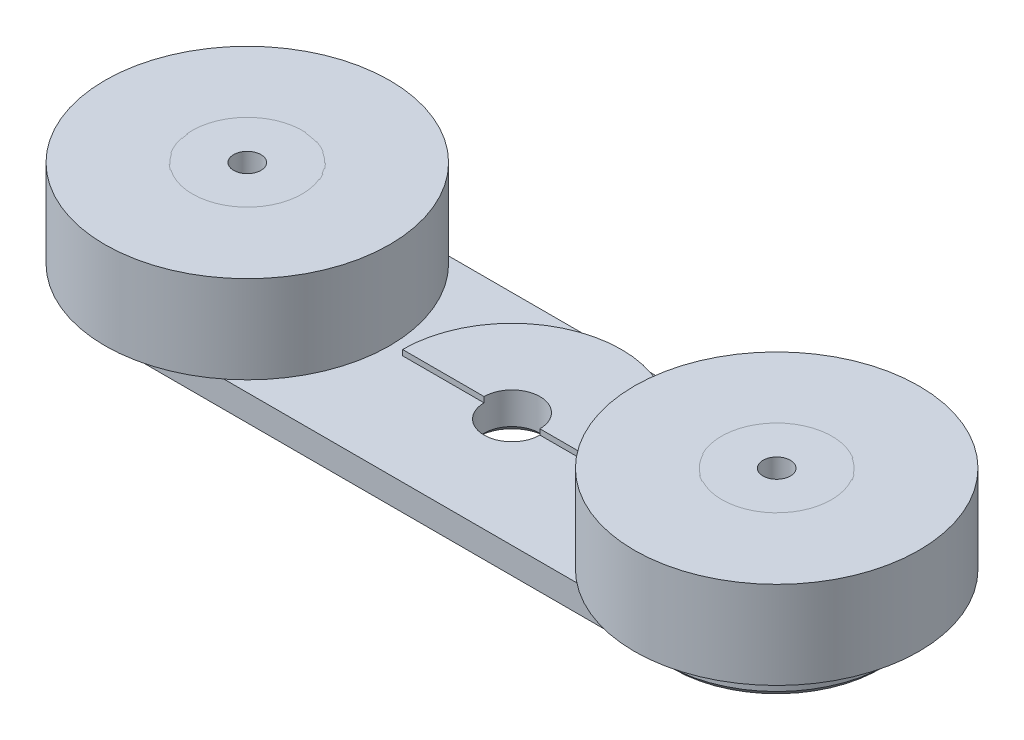
ISO-10303-21;
HEADER;
FILE_DESCRIPTION(('STEP AP214'),'2;1');
FILE_NAME('part.step','',(''),(''),'','','');
FILE_SCHEMA(('AUTOMOTIVE_DESIGN { 1 0 10303 214 1 1 1 1 }'));
ENDSEC;
DATA;
#1=APPLICATION_CONTEXT('core data for automotive mechanical design processes');
#2=APPLICATION_PROTOCOL_DEFINITION('international standard','automotive_design',2000,#1);
#3=PRODUCT_CONTEXT('',#1,'mechanical');
#4=PRODUCT('Part','Part','',(#3));
#5=PRODUCT_RELATED_PRODUCT_CATEGORY('part','',(#4));
#6=PRODUCT_DEFINITION_FORMATION('','',#4);
#7=PRODUCT_DEFINITION_CONTEXT('part definition',#1,'design');
#8=PRODUCT_DEFINITION('design','',#6,#7);
#9=PRODUCT_DEFINITION_SHAPE('','',#8);
#10=(LENGTH_UNIT() NAMED_UNIT(*) SI_UNIT(.MILLI.,.METRE.));
#11=(NAMED_UNIT(*) PLANE_ANGLE_UNIT() SI_UNIT($,.RADIAN.));
#12=(NAMED_UNIT(*) SI_UNIT($,.STERADIAN.) SOLID_ANGLE_UNIT());
#13=UNCERTAINTY_MEASURE_WITH_UNIT(LENGTH_MEASURE(1.E-05),#10,'distance_accuracy_value','');
#14=(GEOMETRIC_REPRESENTATION_CONTEXT(3) GLOBAL_UNCERTAINTY_ASSIGNED_CONTEXT((#13)) GLOBAL_UNIT_ASSIGNED_CONTEXT((#10,
#11,#12)) REPRESENTATION_CONTEXT('',''));
#15=CARTESIAN_POINT('',(0.,0.,0.));
#16=DIRECTION('',(0.,0.,1.));
#17=DIRECTION('',(1.,0.,0.));
#18=AXIS2_PLACEMENT_3D('',#15,#16,#17);
#19=CARTESIAN_POINT('',(24.175,11.2,0.));
#20=DIRECTION('',(0.,1.,0.));
#21=DIRECTION('',(0.,0.,1.));
#22=AXIS2_PLACEMENT_3D('',#19,#20,#21);
#23=PLANE('',#22);
#24=CARTESIAN_POINT('',(24.175,11.2,0.));
#25=DIRECTION('',(0.,-1.,0.));
#26=DIRECTION('',(0.,0.,1.));
#27=AXIS2_PLACEMENT_3D('',#24,#25,#26);
#28=CIRCLE('',#27,13.);
#29=CARTESIAN_POINT('',(24.175,11.2,13.));
#30=VERTEX_POINT('',#29);
#31=EDGE_CURVE('E11',#30,#30,#28,.T.);
#32=ORIENTED_EDGE('',*,*,#31,.F.);
#33=EDGE_LOOP('',(#32));
#34=FACE_BOUND('',#33,.T.);
#35=CARTESIAN_POINT('',(24.175,11.2,0.));
#36=DIRECTION('',(0.,-1.,0.));
#37=DIRECTION('',(0.,0.,1.));
#38=AXIS2_PLACEMENT_3D('',#35,#36,#37);
#39=CIRCLE('',#38,5.);
#40=CARTESIAN_POINT('',(24.175,11.2,5.00000000000001));
#41=VERTEX_POINT('',#40);
#42=EDGE_CURVE('E58',#41,#41,#39,.T.);
#43=ORIENTED_EDGE('',*,*,#42,.T.);
#44=EDGE_LOOP('',(#43));
#45=FACE_BOUND('',#44,.T.);
#46=ADVANCED_FACE('F47',(#34,#45),#23,.T.);
#47=CARTESIAN_POINT('',(24.175,3.2,0.));
#48=DIRECTION('',(0.,1.,0.));
#49=DIRECTION('',(0.,0.,1.));
#50=AXIS2_PLACEMENT_3D('',#47,#48,#49);
#51=PLANE('',#50);
#52=CARTESIAN_POINT('',(24.175,3.2,0.));
#53=DIRECTION('',(0.,-1.,0.));
#54=DIRECTION('',(0.,0.,1.));
#55=AXIS2_PLACEMENT_3D('',#52,#53,#54);
#56=CIRCLE('',#55,13.);
#57=CARTESIAN_POINT('',(24.175,3.2,13.));
#58=VERTEX_POINT('',#57);
#59=EDGE_CURVE('E51',#58,#58,#56,.T.);
#60=ORIENTED_EDGE('',*,*,#59,.T.);
#61=EDGE_LOOP('',(#60));
#62=FACE_BOUND('',#61,.T.);
#63=CARTESIAN_POINT('',(24.175,3.2,0.));
#64=DIRECTION('',(0.,-1.,0.));
#65=DIRECTION('',(0.,0.,1.));
#66=AXIS2_PLACEMENT_3D('',#63,#64,#65);
#67=CIRCLE('',#66,5.);
#68=CARTESIAN_POINT('',(24.175,3.2,5.00000000000001));
#69=VERTEX_POINT('',#68);
#70=EDGE_CURVE('E60',#69,#69,#67,.T.);
#71=ORIENTED_EDGE('',*,*,#70,.F.);
#72=EDGE_LOOP('',(#71));
#73=FACE_BOUND('',#72,.T.);
#74=ADVANCED_FACE('F73',(#62,#73),#51,.F.);
#75=CARTESIAN_POINT('',(24.175,11.2,0.));
#76=DIRECTION('',(0.,-1.,0.));
#77=DIRECTION('',(0.,0.,-1.));
#78=AXIS2_PLACEMENT_3D('',#75,#76,#77);
#79=CYLINDRICAL_SURFACE('',#78,13.);
#80=ORIENTED_EDGE('',*,*,#31,.T.);
#81=EDGE_LOOP('',(#80));
#82=FACE_BOUND('',#81,.T.);
#83=ORIENTED_EDGE('',*,*,#59,.F.);
#84=EDGE_LOOP('',(#83));
#85=FACE_BOUND('',#84,.T.);
#86=ADVANCED_FACE('F49',(#82,#85),#79,.T.);
#87=CARTESIAN_POINT('',(24.175,11.2,0.));
#88=DIRECTION('',(0.,-1.,0.));
#89=DIRECTION('',(0.,0.,-1.));
#90=AXIS2_PLACEMENT_3D('',#87,#88,#89);
#91=CYLINDRICAL_SURFACE('',#90,5.);
#92=ORIENTED_EDGE('',*,*,#42,.F.);
#93=EDGE_LOOP('',(#92));
#94=FACE_BOUND('',#93,.T.);
#95=ORIENTED_EDGE('',*,*,#70,.T.);
#96=EDGE_LOOP('',(#95));
#97=FACE_BOUND('',#96,.T.);
#98=ADVANCED_FACE('F67',(#94,#97),#91,.F.);
#99=CLOSED_SHELL('',(#46,#74,#86,#98));
#100=MANIFOLD_SOLID_BREP('B2_NOT_SHOWN',#99);
#101=CARTESIAN_POINT('',(-24.175,11.2,0.));
#102=DIRECTION('',(0.,1.,0.));
#103=DIRECTION('',(0.,0.,1.));
#104=AXIS2_PLACEMENT_3D('',#101,#102,#103);
#105=PLANE('',#104);
#106=CARTESIAN_POINT('',(-24.175,11.2,0.));
#107=DIRECTION('',(0.,1.,0.));
#108=DIRECTION('',(0.,0.,1.));
#109=AXIS2_PLACEMENT_3D('',#106,#107,#108);
#110=CIRCLE('',#109,13.);
#111=CARTESIAN_POINT('',(-24.175,11.2,13.));
#112=VERTEX_POINT('',#111);
#113=EDGE_CURVE('E46',#112,#112,#110,.T.);
#114=ORIENTED_EDGE('',*,*,#113,.T.);
#115=EDGE_LOOP('',(#114));
#116=FACE_BOUND('',#115,.T.);
#117=CARTESIAN_POINT('',(-24.175,11.2,0.));
#118=DIRECTION('',(0.,1.,0.));
#119=DIRECTION('',(0.,0.,1.));
#120=AXIS2_PLACEMENT_3D('',#117,#118,#119);
#121=CIRCLE('',#120,5.);
#122=CARTESIAN_POINT('',(-24.175,11.2,5.00000000000001));
#123=VERTEX_POINT('',#122);
#124=EDGE_CURVE('E149',#123,#123,#121,.T.);
#125=ORIENTED_EDGE('',*,*,#124,.F.);
#126=EDGE_LOOP('',(#125));
#127=FACE_BOUND('',#126,.T.);
#128=ADVANCED_FACE('F138',(#116,#127),#105,.T.);
#129=CARTESIAN_POINT('',(-24.175,3.2,0.));
#130=DIRECTION('',(0.,1.,0.));
#131=DIRECTION('',(0.,0.,1.));
#132=AXIS2_PLACEMENT_3D('',#129,#130,#131);
#133=PLANE('',#132);
#134=CARTESIAN_POINT('',(-24.175,3.2,0.));
#135=DIRECTION('',(0.,1.,0.));
#136=DIRECTION('',(0.,0.,1.));
#137=AXIS2_PLACEMENT_3D('',#134,#135,#136);
#138=CIRCLE('',#137,13.);
#139=CARTESIAN_POINT('',(-24.175,3.2,13.));
#140=VERTEX_POINT('',#139);
#141=EDGE_CURVE('E142',#140,#140,#138,.T.);
#142=ORIENTED_EDGE('',*,*,#141,.F.);
#143=EDGE_LOOP('',(#142));
#144=FACE_BOUND('',#143,.T.);
#145=CARTESIAN_POINT('',(-24.175,3.2,0.));
#146=DIRECTION('',(0.,1.,0.));
#147=DIRECTION('',(0.,0.,1.));
#148=AXIS2_PLACEMENT_3D('',#145,#146,#147);
#149=CIRCLE('',#148,5.);
#150=CARTESIAN_POINT('',(-24.175,3.2,5.00000000000001));
#151=VERTEX_POINT('',#150);
#152=EDGE_CURVE('E151',#151,#151,#149,.T.);
#153=ORIENTED_EDGE('',*,*,#152,.T.);
#154=EDGE_LOOP('',(#153));
#155=FACE_BOUND('',#154,.T.);
#156=ADVANCED_FACE('F161',(#144,#155),#133,.F.);
#157=CARTESIAN_POINT('',(-24.175,11.2,0.));
#158=DIRECTION('',(0.,-1.,0.));
#159=DIRECTION('',(0.,0.,-1.));
#160=AXIS2_PLACEMENT_3D('',#157,#158,#159);
#161=CYLINDRICAL_SURFACE('',#160,13.);
#162=ORIENTED_EDGE('',*,*,#113,.F.);
#163=EDGE_LOOP('',(#162));
#164=FACE_BOUND('',#163,.T.);
#165=ORIENTED_EDGE('',*,*,#141,.T.);
#166=EDGE_LOOP('',(#165));
#167=FACE_BOUND('',#166,.T.);
#168=ADVANCED_FACE('F140',(#164,#167),#161,.T.);
#169=CARTESIAN_POINT('',(-24.175,11.2,0.));
#170=DIRECTION('',(0.,-1.,0.));
#171=DIRECTION('',(0.,0.,-1.));
#172=AXIS2_PLACEMENT_3D('',#169,#170,#171);
#173=CYLINDRICAL_SURFACE('',#172,5.);
#174=ORIENTED_EDGE('',*,*,#124,.T.);
#175=EDGE_LOOP('',(#174));
#176=FACE_BOUND('',#175,.T.);
#177=ORIENTED_EDGE('',*,*,#152,.F.);
#178=EDGE_LOOP('',(#177));
#179=FACE_BOUND('',#178,.T.);
#180=ADVANCED_FACE('F157',(#176,#179),#173,.F.);
#181=CLOSED_SHELL('',(#128,#156,#168,#180));
#182=MANIFOLD_SOLID_BREP('B6_NOT_SHOWN',#181);
#183=CARTESIAN_POINT('',(24.175,3.,0.));
#184=DIRECTION('',(0.,1.,0.));
#185=DIRECTION('',(0.,0.,1.));
#186=AXIS2_PLACEMENT_3D('',#183,#184,#185);
#187=PLANE('',#186);
#188=CARTESIAN_POINT('',(24.175,3.,0.));
#189=DIRECTION('',(0.,1.,0.));
#190=DIRECTION('',(0.,0.,1.));
#191=AXIS2_PLACEMENT_3D('',#188,#189,#190);
#192=CIRCLE('',#191,7.5);
#193=CARTESIAN_POINT('',(24.175,3.,7.49999999999999));
#194=VERTEX_POINT('',#193);
#195=EDGE_CURVE('E335',#194,#194,#192,.T.);
#196=ORIENTED_EDGE('',*,*,#195,.F.);
#197=EDGE_LOOP('',(#196));
#198=FACE_BOUND('',#197,.T.);
#199=CARTESIAN_POINT('',(-24.175,3.,0.));
#200=DIRECTION('',(0.,1.,0.));
#201=DIRECTION('',(0.,0.,1.));
#202=AXIS2_PLACEMENT_3D('',#199,#200,#201);
#203=CIRCLE('',#202,7.5);
#204=CARTESIAN_POINT('',(-24.175,3.,7.50000000000001));
#205=VERTEX_POINT('',#204);
#206=EDGE_CURVE('E342',#205,#205,#203,.T.);
#207=ORIENTED_EDGE('',*,*,#206,.F.);
#208=EDGE_LOOP('',(#207));
#209=FACE_BOUND('',#208,.T.);
#210=CARTESIAN_POINT('',(0.,3.,0.));
#211=DIRECTION('',(0.,1.,0.));
#212=DIRECTION('',(0.,0.,1.));
#213=AXIS2_PLACEMENT_3D('',#210,#211,#212);
#214=CIRCLE('',#213,2.55);
#215=CARTESIAN_POINT('',(-2.55,3.,0.));
#216=VERTEX_POINT('',#215);
#217=CARTESIAN_POINT('',(2.55,3.,0.));
#218=VERTEX_POINT('',#217);
#219=EDGE_CURVE('E348',#216,#218,#214,.T.);
#220=ORIENTED_EDGE('',*,*,#219,.F.);
#221=DIRECTION('',(1.,0.,0.));
#222=VECTOR('',#221,1.);
#223=CARTESIAN_POINT('',(-10.,3.,0.));
#224=LINE('',#223,#222);
#225=CARTESIAN_POINT('',(-10.,3.,0.));
#226=VERTEX_POINT('',#225);
#227=EDGE_CURVE('E418',#226,#216,#224,.T.);
#228=ORIENTED_EDGE('',*,*,#227,.F.);
#229=CARTESIAN_POINT('',(0.,3.,0.));
#230=DIRECTION('',(0.,1.,0.));
#231=DIRECTION('',(0.,0.,1.));
#232=AXIS2_PLACEMENT_3D('',#229,#230,#231);
#233=CIRCLE('',#232,10.);
#234=CARTESIAN_POINT('',(0.,3.,-10.));
#235=VERTEX_POINT('',#234);
#236=EDGE_CURVE('E312',#235,#226,#233,.T.);
#237=ORIENTED_EDGE('',*,*,#236,.F.);
#238=DIRECTION('',(-1.,0.,0.));
#239=VECTOR('',#238,1.);
#240=CARTESIAN_POINT('',(24.175,3.,-10.));
#241=LINE('',#240,#239);
#242=CARTESIAN_POINT('',(-24.175,3.,-9.99999999999998));
#243=VERTEX_POINT('',#242);
#244=EDGE_CURVE('E356',#235,#243,#241,.T.);
#245=ORIENTED_EDGE('',*,*,#244,.T.);
#246=CARTESIAN_POINT('',(-24.175,3.,0.));
#247=DIRECTION('',(0.,1.,0.));
#248=DIRECTION('',(0.,0.,1.));
#249=AXIS2_PLACEMENT_3D('',#246,#247,#248);
#250=CIRCLE('',#249,10.);
#251=CARTESIAN_POINT('',(-24.175,3.,10.));
#252=VERTEX_POINT('',#251);
#253=EDGE_CURVE('E360',#243,#252,#250,.T.);
#254=ORIENTED_EDGE('',*,*,#253,.T.);
#255=DIRECTION('',(1.,0.,0.));
#256=VECTOR('',#255,1.);
#257=CARTESIAN_POINT('',(24.175,3.,9.99999999999999));
#258=LINE('',#257,#256);
#259=CARTESIAN_POINT('',(24.175,3.,9.99999999999999));
#260=VERTEX_POINT('',#259);
#261=EDGE_CURVE('E362',#252,#260,#258,.T.);
#262=ORIENTED_EDGE('',*,*,#261,.T.);
#263=CARTESIAN_POINT('',(24.175,3.,0.));
#264=DIRECTION('',(0.,1.,0.));
#265=DIRECTION('',(0.,0.,1.));
#266=AXIS2_PLACEMENT_3D('',#263,#264,#265);
#267=CIRCLE('',#266,10.);
#268=CARTESIAN_POINT('',(24.175,3.,-10.));
#269=VERTEX_POINT('',#268);
#270=EDGE_CURVE('E353',#260,#269,#267,.T.);
#271=ORIENTED_EDGE('',*,*,#270,.T.);
#272=EDGE_CURVE('E357',#269,#235,#241,.T.);
#273=ORIENTED_EDGE('',*,*,#272,.T.);
#274=CARTESIAN_POINT('',(10.,3.,0.));
#275=VERTEX_POINT('',#274);
#276=EDGE_CURVE('E416',#275,#235,#233,.T.);
#277=ORIENTED_EDGE('',*,*,#276,.F.);
#278=DIRECTION('',(1.,0.,0.));
#279=VECTOR('',#278,1.);
#280=CARTESIAN_POINT('',(2.55,3.,0.));
#281=LINE('',#280,#279);
#282=EDGE_CURVE('E308',#218,#275,#281,.T.);
#283=ORIENTED_EDGE('',*,*,#282,.F.);
#284=EDGE_LOOP('',(#220,#228,#237,#245,#254,#262,#271,#273,#277,#283));
#285=FACE_BOUND('',#284,.T.);
#286=ADVANCED_FACE('F205',(#198,#209,#285),#187,.T.);
#287=CARTESIAN_POINT('',(24.175,0.,0.));
#288=DIRECTION('',(0.,1.,0.));
#289=DIRECTION('',(0.,0.,1.));
#290=AXIS2_PLACEMENT_3D('',#287,#288,#289);
#291=PLANE('',#290);
#292=CARTESIAN_POINT('',(24.175,0.,0.));
#293=DIRECTION('',(0.,1.,0.));
#294=DIRECTION('',(0.,0.,1.));
#295=AXIS2_PLACEMENT_3D('',#292,#293,#294);
#296=CIRCLE('',#295,1.85);
#297=CARTESIAN_POINT('',(24.175,0.,1.85));
#298=VERTEX_POINT('',#297);
#299=EDGE_CURVE('E386',#298,#298,#296,.T.);
#300=ORIENTED_EDGE('',*,*,#299,.T.);
#301=EDGE_LOOP('',(#300));
#302=FACE_BOUND('',#301,.T.);
#303=CARTESIAN_POINT('',(0.,0.,0.));
#304=DIRECTION('',(0.,1.,0.));
#305=DIRECTION('',(0.,0.,1.));
#306=AXIS2_PLACEMENT_3D('',#303,#304,#305);
#307=CIRCLE('',#306,3.15);
#308=CARTESIAN_POINT('',(0.,0.,3.15));
#309=VERTEX_POINT('',#308);
#310=EDGE_CURVE('E383',#309,#309,#307,.T.);
#311=ORIENTED_EDGE('',*,*,#310,.T.);
#312=EDGE_LOOP('',(#311));
#313=FACE_BOUND('',#312,.T.);
#314=CARTESIAN_POINT('',(-24.175,0.,0.));
#315=DIRECTION('',(0.,1.,0.));
#316=DIRECTION('',(0.,0.,1.));
#317=AXIS2_PLACEMENT_3D('',#314,#315,#316);
#318=CIRCLE('',#317,1.85);
#319=CARTESIAN_POINT('',(-24.175,0.,1.85));
#320=VERTEX_POINT('',#319);
#321=EDGE_CURVE('E380',#320,#320,#318,.T.);
#322=ORIENTED_EDGE('',*,*,#321,.T.);
#323=EDGE_LOOP('',(#322));
#324=FACE_BOUND('',#323,.T.);
#325=DIRECTION('',(1.,0.,0.));
#326=VECTOR('',#325,1.);
#327=CARTESIAN_POINT('',(24.175,0.,-9.40000000000001));
#328=LINE('',#327,#326);
#329=CARTESIAN_POINT('',(-24.175,0.,-9.39999999999998));
#330=VERTEX_POINT('',#329);
#331=CARTESIAN_POINT('',(24.175,0.,-9.40000000000001));
#332=VERTEX_POINT('',#331);
#333=EDGE_CURVE('E375',#330,#332,#328,.T.);
#334=ORIENTED_EDGE('',*,*,#333,.T.);
#335=CARTESIAN_POINT('',(24.175,0.,0.));
#336=DIRECTION('',(0.,1.,0.));
#337=DIRECTION('',(0.,0.,1.));
#338=AXIS2_PLACEMENT_3D('',#335,#336,#337);
#339=CIRCLE('',#338,9.4);
#340=CARTESIAN_POINT('',(24.175,0.,9.39999999999998));
#341=VERTEX_POINT('',#340);
#342=EDGE_CURVE('E377',#332,#341,#339,.F.);
#343=ORIENTED_EDGE('',*,*,#342,.T.);
#344=DIRECTION('',(-1.,0.,0.));
#345=VECTOR('',#344,1.);
#346=CARTESIAN_POINT('',(24.175,0.,9.39999999999998));
#347=LINE('',#346,#345);
#348=CARTESIAN_POINT('',(-24.175,0.,9.40000000000001));
#349=VERTEX_POINT('',#348);
#350=EDGE_CURVE('E373',#341,#349,#347,.T.);
#351=ORIENTED_EDGE('',*,*,#350,.T.);
#352=CARTESIAN_POINT('',(-24.175,0.,0.));
#353=DIRECTION('',(0.,1.,0.));
#354=DIRECTION('',(0.,0.,1.));
#355=AXIS2_PLACEMENT_3D('',#352,#353,#354);
#356=CIRCLE('',#355,9.4);
#357=EDGE_CURVE('E331',#349,#330,#356,.F.);
#358=ORIENTED_EDGE('',*,*,#357,.T.);
#359=EDGE_LOOP('',(#334,#343,#351,#358));
#360=FACE_BOUND('',#359,.T.);
#361=ADVANCED_FACE('F459',(#302,#313,#324,#360),#291,.F.);
#362=CARTESIAN_POINT('',(24.175,3.,0.));
#363=DIRECTION('',(0.,-1.,0.));
#364=DIRECTION('',(0.,0.,-1.));
#365=AXIS2_PLACEMENT_3D('',#362,#363,#364);
#366=CYLINDRICAL_SURFACE('',#365,10.);
#367=DIRECTION('',(0.,-1.,0.));
#368=VECTOR('',#367,1.);
#369=CARTESIAN_POINT('',(24.175,3.,9.99999999999999));
#370=LINE('',#369,#368);
#371=CARTESIAN_POINT('',(24.175,0.600000000000017,10.));
#372=VERTEX_POINT('',#371);
#373=EDGE_CURVE('E364',#260,#372,#370,.T.);
#374=ORIENTED_EDGE('',*,*,#373,.T.);
#375=CARTESIAN_POINT('',(24.175,0.600000000000017,0.));
#376=DIRECTION('',(0.,1.,0.));
#377=DIRECTION('',(0.,0.,1.));
#378=AXIS2_PLACEMENT_3D('',#375,#376,#377);
#379=CIRCLE('',#378,10.);
#380=CARTESIAN_POINT('',(24.175,0.600000000000017,-10.));
#381=VERTEX_POINT('',#380);
#382=EDGE_CURVE('E398',#372,#381,#379,.T.);
#383=ORIENTED_EDGE('',*,*,#382,.T.);
#384=DIRECTION('',(0.,-1.,0.));
#385=VECTOR('',#384,1.);
#386=CARTESIAN_POINT('',(24.175,3.,-10.));
#387=LINE('',#386,#385);
#388=EDGE_CURVE('E338',#269,#381,#387,.T.);
#389=ORIENTED_EDGE('',*,*,#388,.F.);
#390=ORIENTED_EDGE('',*,*,#270,.F.);
#391=EDGE_LOOP('',(#374,#383,#389,#390));
#392=FACE_BOUND('',#391,.T.);
#393=ADVANCED_FACE('F442',(#392),#366,.T.);
#394=CARTESIAN_POINT('',(24.175,3.,-10.));
#395=DIRECTION('',(0.,0.,1.));
#396=DIRECTION('',(1.,0.,0.));
#397=AXIS2_PLACEMENT_3D('',#394,#395,#396);
#398=PLANE('',#397);
#399=ORIENTED_EDGE('',*,*,#388,.T.);
#400=DIRECTION('',(-1.,0.,0.));
#401=VECTOR('',#400,1.);
#402=CARTESIAN_POINT('',(24.175,0.600000000000017,-10.));
#403=LINE('',#402,#401);
#404=CARTESIAN_POINT('',(-24.175,0.600000000000017,-9.99999999999998));
#405=VERTEX_POINT('',#404);
#406=EDGE_CURVE('E228',#381,#405,#403,.T.);
#407=ORIENTED_EDGE('',*,*,#406,.T.);
#408=DIRECTION('',(0.,-1.,0.));
#409=VECTOR('',#408,1.);
#410=CARTESIAN_POINT('',(-24.175,3.,-9.99999999999998));
#411=LINE('',#410,#409);
#412=EDGE_CURVE('E369',#243,#405,#411,.T.);
#413=ORIENTED_EDGE('',*,*,#412,.F.);
#414=ORIENTED_EDGE('',*,*,#244,.F.);
#415=ORIENTED_EDGE('',*,*,#272,.F.);
#416=EDGE_LOOP('',(#399,#407,#413,#414,#415));
#417=FACE_BOUND('',#416,.T.);
#418=ADVANCED_FACE('F435',(#417),#398,.F.);
#419=CARTESIAN_POINT('',(-24.175,3.,0.));
#420=DIRECTION('',(0.,-1.,0.));
#421=DIRECTION('',(0.,0.,-1.));
#422=AXIS2_PLACEMENT_3D('',#419,#420,#421);
#423=CYLINDRICAL_SURFACE('',#422,10.);
#424=ORIENTED_EDGE('',*,*,#412,.T.);
#425=CARTESIAN_POINT('',(-24.175,0.599999999999989,0.));
#426=DIRECTION('',(0.,1.,0.));
#427=DIRECTION('',(0.,0.,1.));
#428=AXIS2_PLACEMENT_3D('',#425,#426,#427);
#429=CIRCLE('',#428,10.);
#430=CARTESIAN_POINT('',(-24.175,0.599999999999989,10.));
#431=VERTEX_POINT('',#430);
#432=EDGE_CURVE('E136',#405,#431,#429,.T.);
#433=ORIENTED_EDGE('',*,*,#432,.T.);
#434=DIRECTION('',(0.,-1.,0.));
#435=VECTOR('',#434,1.);
#436=CARTESIAN_POINT('',(-24.175,3.,10.));
#437=LINE('',#436,#435);
#438=EDGE_CURVE('E367',#252,#431,#437,.T.);
#439=ORIENTED_EDGE('',*,*,#438,.F.);
#440=ORIENTED_EDGE('',*,*,#253,.F.);
#441=EDGE_LOOP('',(#424,#433,#439,#440));
#442=FACE_BOUND('',#441,.T.);
#443=ADVANCED_FACE('F475',(#442),#423,.T.);
#444=CARTESIAN_POINT('',(24.175,3.,9.99999999999999));
#445=DIRECTION('',(0.,0.,-1.));
#446=DIRECTION('',(-1.,0.,0.));
#447=AXIS2_PLACEMENT_3D('',#444,#445,#446);
#448=PLANE('',#447);
#449=ORIENTED_EDGE('',*,*,#438,.T.);
#450=DIRECTION('',(1.,0.,0.));
#451=VECTOR('',#450,1.);
#452=CARTESIAN_POINT('',(24.175,0.600000000000017,10.));
#453=LINE('',#452,#451);
#454=EDGE_CURVE('E214',#431,#372,#453,.T.);
#455=ORIENTED_EDGE('',*,*,#454,.T.);
#456=ORIENTED_EDGE('',*,*,#373,.F.);
#457=ORIENTED_EDGE('',*,*,#261,.F.);
#458=EDGE_LOOP('',(#449,#455,#456,#457));
#459=FACE_BOUND('',#458,.T.);
#460=ADVANCED_FACE('F472',(#459),#448,.F.);
#461=CARTESIAN_POINT('',(0.,3.,0.));
#462=DIRECTION('',(0.,-1.,0.));
#463=DIRECTION('',(0.,0.,-1.));
#464=AXIS2_PLACEMENT_3D('',#461,#462,#463);
#465=CYLINDRICAL_SURFACE('',#464,2.55);
#466=CARTESIAN_POINT('',(0.,0.600000000000017,0.));
#467=DIRECTION('',(0.,1.,0.));
#468=DIRECTION('',(0.,0.,1.));
#469=AXIS2_PLACEMENT_3D('',#466,#467,#468);
#470=CIRCLE('',#469,2.55);
#471=CARTESIAN_POINT('',(0.,0.600000000000017,2.55));
#472=VERTEX_POINT('',#471);
#473=EDGE_CURVE('E392',#472,#472,#470,.F.);
#474=ORIENTED_EDGE('',*,*,#473,.T.);
#475=EDGE_LOOP('',(#474));
#476=FACE_BOUND('',#475,.T.);
#477=ORIENTED_EDGE('',*,*,#219,.T.);
#478=DIRECTION('',(0.,-1.,0.));
#479=VECTOR('',#478,1.);
#480=CARTESIAN_POINT('',(2.55,3.5,0.));
#481=LINE('',#480,#479);
#482=CARTESIAN_POINT('',(2.55,3.5,0.));
#483=VERTEX_POINT('',#482);
#484=EDGE_CURVE('E318',#483,#218,#481,.T.);
#485=ORIENTED_EDGE('',*,*,#484,.F.);
#486=CARTESIAN_POINT('',(0.,3.5,0.));
#487=DIRECTION('',(0.,-1.,0.));
#488=DIRECTION('',(0.,0.,1.));
#489=AXIS2_PLACEMENT_3D('',#486,#487,#488);
#490=CIRCLE('',#489,2.55);
#491=CARTESIAN_POINT('',(-2.55,3.5,0.));
#492=VERTEX_POINT('',#491);
#493=EDGE_CURVE('E298',#492,#483,#490,.T.);
#494=ORIENTED_EDGE('',*,*,#493,.F.);
#495=DIRECTION('',(0.,-1.,0.));
#496=VECTOR('',#495,1.);
#497=CARTESIAN_POINT('',(-2.55,3.5,0.));
#498=LINE('',#497,#496);
#499=EDGE_CURVE('E295',#492,#216,#498,.T.);
#500=ORIENTED_EDGE('',*,*,#499,.T.);
#501=EDGE_LOOP('',(#477,#485,#494,#500));
#502=FACE_BOUND('',#501,.T.);
#503=ADVANCED_FACE('F433',(#476,#502),#465,.F.);
#504=CARTESIAN_POINT('',(-24.175,3.20000000000001,0.));
#505=DIRECTION('',(0.,-1.,0.));
#506=DIRECTION('',(0.,0.,-1.));
#507=AXIS2_PLACEMENT_3D('',#504,#505,#506);
#508=CYLINDRICAL_SURFACE('',#507,7.5);
#509=CARTESIAN_POINT('',(-24.175,3.20000000000001,0.));
#510=DIRECTION('',(0.,1.,0.));
#511=DIRECTION('',(0.,0.,1.));
#512=AXIS2_PLACEMENT_3D('',#509,#510,#511);
#513=CIRCLE('',#512,7.5);
#514=CARTESIAN_POINT('',(-24.175,3.20000000000001,7.50000000000001));
#515=VERTEX_POINT('',#514);
#516=EDGE_CURVE('E345',#515,#515,#513,.T.);
#517=ORIENTED_EDGE('',*,*,#516,.F.);
#518=EDGE_LOOP('',(#517));
#519=FACE_BOUND('',#518,.T.);
#520=ORIENTED_EDGE('',*,*,#206,.T.);
#521=EDGE_LOOP('',(#520));
#522=FACE_BOUND('',#521,.T.);
#523=ADVANCED_FACE('F530',(#519,#522),#508,.T.);
#524=CARTESIAN_POINT('',(-24.175,3.20000000000001,0.));
#525=DIRECTION('',(0.,1.,0.));
#526=DIRECTION('',(0.,0.,1.));
#527=AXIS2_PLACEMENT_3D('',#524,#525,#526);
#528=PLANE('',#527);
#529=CARTESIAN_POINT('',(-24.175,3.20000000000001,0.));
#530=DIRECTION('',(0.,1.,0.));
#531=DIRECTION('',(0.,0.,1.));
#532=AXIS2_PLACEMENT_3D('',#529,#530,#531);
#533=CIRCLE('',#532,5.05);
#534=CARTESIAN_POINT('',(-24.175,3.20000000000001,5.05000000000001));
#535=VERTEX_POINT('',#534);
#536=EDGE_CURVE('E332',#535,#535,#533,.T.);
#537=ORIENTED_EDGE('',*,*,#536,.F.);
#538=EDGE_LOOP('',(#537));
#539=FACE_BOUND('',#538,.T.);
#540=ORIENTED_EDGE('',*,*,#516,.T.);
#541=EDGE_LOOP('',(#540));
#542=FACE_BOUND('',#541,.T.);
#543=ADVANCED_FACE('F526',(#539,#542),#528,.T.);
#544=CARTESIAN_POINT('',(24.175,3.20000000000001,0.));
#545=DIRECTION('',(0.,-1.,0.));
#546=DIRECTION('',(0.,0.,-1.));
#547=AXIS2_PLACEMENT_3D('',#544,#545,#546);
#548=CYLINDRICAL_SURFACE('',#547,7.5);
#549=CARTESIAN_POINT('',(24.175,3.20000000000001,0.));
#550=DIRECTION('',(0.,1.,0.));
#551=DIRECTION('',(0.,0.,1.));
#552=AXIS2_PLACEMENT_3D('',#549,#550,#551);
#553=CIRCLE('',#552,7.5);
#554=CARTESIAN_POINT('',(24.175,3.20000000000001,7.49999999999999));
#555=VERTEX_POINT('',#554);
#556=EDGE_CURVE('E339',#555,#555,#553,.T.);
#557=ORIENTED_EDGE('',*,*,#556,.F.);
#558=EDGE_LOOP('',(#557));
#559=FACE_BOUND('',#558,.T.);
#560=ORIENTED_EDGE('',*,*,#195,.T.);
#561=EDGE_LOOP('',(#560));
#562=FACE_BOUND('',#561,.T.);
#563=ADVANCED_FACE('F529',(#559,#562),#548,.T.);
#564=CARTESIAN_POINT('',(24.175,3.20000000000001,0.));
#565=DIRECTION('',(0.,1.,0.));
#566=DIRECTION('',(0.,0.,1.));
#567=AXIS2_PLACEMENT_3D('',#564,#565,#566);
#568=PLANE('',#567);
#569=CARTESIAN_POINT('',(24.175,3.20000000000001,0.));
#570=DIRECTION('',(0.,1.,0.));
#571=DIRECTION('',(0.,0.,1.));
#572=AXIS2_PLACEMENT_3D('',#569,#570,#571);
#573=CIRCLE('',#572,5.05);
#574=CARTESIAN_POINT('',(24.175,3.20000000000001,5.04999999999999));
#575=VERTEX_POINT('',#574);
#576=EDGE_CURVE('E328',#575,#575,#573,.T.);
#577=ORIENTED_EDGE('',*,*,#576,.F.);
#578=EDGE_LOOP('',(#577));
#579=FACE_BOUND('',#578,.T.);
#580=ORIENTED_EDGE('',*,*,#556,.T.);
#581=EDGE_LOOP('',(#580));
#582=FACE_BOUND('',#581,.T.);
#583=ADVANCED_FACE('F522',(#579,#582),#568,.T.);
#584=CARTESIAN_POINT('',(-24.175,11.2,0.));
#585=DIRECTION('',(0.,-1.,0.));
#586=DIRECTION('',(0.,0.,-1.));
#587=AXIS2_PLACEMENT_3D('',#584,#585,#586);
#588=CYLINDRICAL_SURFACE('',#587,5.05);
#589=CARTESIAN_POINT('',(-24.175,11.2,0.));
#590=DIRECTION('',(0.,1.,0.));
#591=DIRECTION('',(0.,0.,1.));
#592=AXIS2_PLACEMENT_3D('',#589,#590,#591);
#593=CIRCLE('',#592,5.05);
#594=CARTESIAN_POINT('',(-24.175,11.2,5.05000000000001));
#595=VERTEX_POINT('',#594);
#596=EDGE_CURVE('E327',#595,#595,#593,.T.);
#597=ORIENTED_EDGE('',*,*,#596,.F.);
#598=EDGE_LOOP('',(#597));
#599=FACE_BOUND('',#598,.T.);
#600=ORIENTED_EDGE('',*,*,#536,.T.);
#601=EDGE_LOOP('',(#600));
#602=FACE_BOUND('',#601,.T.);
#603=ADVANCED_FACE('F516',(#599,#602),#588,.T.);
#604=CARTESIAN_POINT('',(-24.175,11.2,0.));
#605=DIRECTION('',(0.,1.,0.));
#606=DIRECTION('',(0.,0.,1.));
#607=AXIS2_PLACEMENT_3D('',#604,#605,#606);
#608=PLANE('',#607);
#609=CARTESIAN_POINT('',(-24.175,11.2,0.));
#610=DIRECTION('',(0.,1.,0.));
#611=DIRECTION('',(0.,0.,1.));
#612=AXIS2_PLACEMENT_3D('',#609,#610,#611);
#613=CIRCLE('',#612,1.25);
#614=CARTESIAN_POINT('',(-24.175,11.2,1.25000000000001));
#615=VERTEX_POINT('',#614);
#616=EDGE_CURVE('E316',#615,#615,#613,.T.);
#617=ORIENTED_EDGE('',*,*,#616,.F.);
#618=EDGE_LOOP('',(#617));
#619=FACE_BOUND('',#618,.T.);
#620=ORIENTED_EDGE('',*,*,#596,.T.);
#621=EDGE_LOOP('',(#620));
#622=FACE_BOUND('',#621,.T.);
#623=ADVANCED_FACE('F512',(#619,#622),#608,.T.);
#624=CARTESIAN_POINT('',(24.175,11.2,0.));
#625=DIRECTION('',(0.,-1.,0.));
#626=DIRECTION('',(0.,0.,-1.));
#627=AXIS2_PLACEMENT_3D('',#624,#625,#626);
#628=CYLINDRICAL_SURFACE('',#627,5.05);
#629=CARTESIAN_POINT('',(24.175,11.2,0.));
#630=DIRECTION('',(0.,1.,0.));
#631=DIRECTION('',(0.,0.,1.));
#632=AXIS2_PLACEMENT_3D('',#629,#630,#631);
#633=CIRCLE('',#632,5.05);
#634=CARTESIAN_POINT('',(24.175,11.2,5.04999999999999));
#635=VERTEX_POINT('',#634);
#636=EDGE_CURVE('E323',#635,#635,#633,.T.);
#637=ORIENTED_EDGE('',*,*,#636,.F.);
#638=EDGE_LOOP('',(#637));
#639=FACE_BOUND('',#638,.T.);
#640=ORIENTED_EDGE('',*,*,#576,.T.);
#641=EDGE_LOOP('',(#640));
#642=FACE_BOUND('',#641,.T.);
#643=ADVANCED_FACE('F515',(#639,#642),#628,.T.);
#644=CARTESIAN_POINT('',(24.175,11.2,0.));
#645=DIRECTION('',(0.,1.,0.));
#646=DIRECTION('',(0.,0.,1.));
#647=AXIS2_PLACEMENT_3D('',#644,#645,#646);
#648=PLANE('',#647);
#649=CARTESIAN_POINT('',(24.175,11.2,0.));
#650=DIRECTION('',(0.,1.,0.));
#651=DIRECTION('',(0.,0.,1.));
#652=AXIS2_PLACEMENT_3D('',#649,#650,#651);
#653=CIRCLE('',#652,1.25);
#654=CARTESIAN_POINT('',(24.175,11.2,1.25000000000001));
#655=VERTEX_POINT('',#654);
#656=EDGE_CURVE('E313',#655,#655,#653,.T.);
#657=ORIENTED_EDGE('',*,*,#656,.F.);
#658=EDGE_LOOP('',(#657));
#659=FACE_BOUND('',#658,.T.);
#660=ORIENTED_EDGE('',*,*,#636,.T.);
#661=EDGE_LOOP('',(#660));
#662=FACE_BOUND('',#661,.T.);
#663=ADVANCED_FACE('F550',(#659,#662),#648,.T.);
#664=CARTESIAN_POINT('',(24.175,0.,0.));
#665=DIRECTION('',(0.,1.,0.));
#666=DIRECTION('',(0.,0.,1.));
#667=AXIS2_PLACEMENT_3D('',#664,#665,#666);
#668=CYLINDRICAL_SURFACE('',#667,1.25);
#669=CARTESIAN_POINT('',(24.175,0.599999999999989,0.));
#670=DIRECTION('',(0.,1.,0.));
#671=DIRECTION('',(0.,0.,1.));
#672=AXIS2_PLACEMENT_3D('',#669,#670,#671);
#673=CIRCLE('',#672,1.25);
#674=CARTESIAN_POINT('',(24.175,0.599999999999989,1.25000000000001));
#675=VERTEX_POINT('',#674);
#676=EDGE_CURVE('E389',#675,#675,#673,.F.);
#677=ORIENTED_EDGE('',*,*,#676,.T.);
#678=EDGE_LOOP('',(#677));
#679=FACE_BOUND('',#678,.T.);
#680=ORIENTED_EDGE('',*,*,#656,.T.);
#681=EDGE_LOOP('',(#680));
#682=FACE_BOUND('',#681,.T.);
#683=ADVANCED_FACE('F508',(#679,#682),#668,.F.);
#684=CARTESIAN_POINT('',(-24.175,0.,0.));
#685=DIRECTION('',(0.,1.,0.));
#686=DIRECTION('',(0.,0.,1.));
#687=AXIS2_PLACEMENT_3D('',#684,#685,#686);
#688=CYLINDRICAL_SURFACE('',#687,1.25);
#689=CARTESIAN_POINT('',(-24.175,0.599999999999989,0.));
#690=DIRECTION('',(0.,1.,0.));
#691=DIRECTION('',(0.,0.,1.));
#692=AXIS2_PLACEMENT_3D('',#689,#690,#691);
#693=CIRCLE('',#692,1.25);
#694=CARTESIAN_POINT('',(-24.175,0.599999999999989,1.25000000000001));
#695=VERTEX_POINT('',#694);
#696=EDGE_CURVE('E395',#695,#695,#693,.F.);
#697=ORIENTED_EDGE('',*,*,#696,.T.);
#698=EDGE_LOOP('',(#697));
#699=FACE_BOUND('',#698,.T.);
#700=ORIENTED_EDGE('',*,*,#616,.T.);
#701=EDGE_LOOP('',(#700));
#702=FACE_BOUND('',#701,.T.);
#703=ADVANCED_FACE('F505',(#699,#702),#688,.F.);
#704=CARTESIAN_POINT('',(0.,3.5,0.));
#705=DIRECTION('',(0.,-1.,0.));
#706=DIRECTION('',(0.,0.,-1.));
#707=AXIS2_PLACEMENT_3D('',#704,#705,#706);
#708=CYLINDRICAL_SURFACE('',#707,10.);
#709=ORIENTED_EDGE('',*,*,#276,.T.);
#710=ORIENTED_EDGE('',*,*,#236,.T.);
#711=DIRECTION('',(0.,-1.,0.));
#712=VECTOR('',#711,1.);
#713=CARTESIAN_POINT('',(-10.,3.5,0.));
#714=LINE('',#713,#712);
#715=CARTESIAN_POINT('',(-10.,3.5,0.));
#716=VERTEX_POINT('',#715);
#717=EDGE_CURVE('E293',#716,#226,#714,.T.);
#718=ORIENTED_EDGE('',*,*,#717,.F.);
#719=CARTESIAN_POINT('',(0.,3.5,0.));
#720=DIRECTION('',(0.,1.,0.));
#721=DIRECTION('',(0.,0.,1.));
#722=AXIS2_PLACEMENT_3D('',#719,#720,#721);
#723=CIRCLE('',#722,10.);
#724=CARTESIAN_POINT('',(10.,3.5,0.));
#725=VERTEX_POINT('',#724);
#726=EDGE_CURVE('E299',#725,#716,#723,.T.);
#727=ORIENTED_EDGE('',*,*,#726,.F.);
#728=DIRECTION('',(0.,-1.,0.));
#729=VECTOR('',#728,1.);
#730=CARTESIAN_POINT('',(10.,3.5,0.));
#731=LINE('',#730,#729);
#732=EDGE_CURVE('E424',#725,#275,#731,.T.);
#733=ORIENTED_EDGE('',*,*,#732,.T.);
#734=EDGE_LOOP('',(#709,#710,#718,#727,#733));
#735=FACE_BOUND('',#734,.T.);
#736=ADVANCED_FACE('F310',(#735),#708,.T.);
#737=CARTESIAN_POINT('',(-10.,3.5,0.));
#738=DIRECTION('',(0.,0.,-1.));
#739=DIRECTION('',(-1.,0.,0.));
#740=AXIS2_PLACEMENT_3D('',#737,#738,#739);
#741=PLANE('',#740);
#742=ORIENTED_EDGE('',*,*,#227,.T.);
#743=ORIENTED_EDGE('',*,*,#499,.F.);
#744=DIRECTION('',(1.,0.,0.));
#745=VECTOR('',#744,1.);
#746=CARTESIAN_POINT('',(-10.,3.5,0.));
#747=LINE('',#746,#745);
#748=EDGE_CURVE('E288',#716,#492,#747,.T.);
#749=ORIENTED_EDGE('',*,*,#748,.F.);
#750=ORIENTED_EDGE('',*,*,#717,.T.);
#751=EDGE_LOOP('',(#742,#743,#749,#750));
#752=FACE_BOUND('',#751,.T.);
#753=ADVANCED_FACE('F291',(#752),#741,.F.);
#754=CARTESIAN_POINT('',(2.55,3.5,0.));
#755=DIRECTION('',(0.,0.,-1.));
#756=DIRECTION('',(-1.,0.,0.));
#757=AXIS2_PLACEMENT_3D('',#754,#755,#756);
#758=PLANE('',#757);
#759=ORIENTED_EDGE('',*,*,#282,.T.);
#760=ORIENTED_EDGE('',*,*,#732,.F.);
#761=DIRECTION('',(1.,0.,0.));
#762=VECTOR('',#761,1.);
#763=CARTESIAN_POINT('',(2.55,3.5,0.));
#764=LINE('',#763,#762);
#765=EDGE_CURVE('E304',#483,#725,#764,.T.);
#766=ORIENTED_EDGE('',*,*,#765,.F.);
#767=ORIENTED_EDGE('',*,*,#484,.T.);
#768=EDGE_LOOP('',(#759,#760,#766,#767));
#769=FACE_BOUND('',#768,.T.);
#770=ADVANCED_FACE('F428',(#769),#758,.F.);
#771=CARTESIAN_POINT('',(0.,3.5,0.));
#772=DIRECTION('',(0.,1.,0.));
#773=DIRECTION('',(0.,0.,1.));
#774=AXIS2_PLACEMENT_3D('',#771,#772,#773);
#775=PLANE('',#774);
#776=ORIENTED_EDGE('',*,*,#726,.T.);
#777=ORIENTED_EDGE('',*,*,#748,.T.);
#778=ORIENTED_EDGE('',*,*,#493,.T.);
#779=ORIENTED_EDGE('',*,*,#765,.T.);
#780=EDGE_LOOP('',(#776,#777,#778,#779));
#781=FACE_BOUND('',#780,.T.);
#782=ADVANCED_FACE('F302',(#781),#775,.T.);
#783=CARTESIAN_POINT('',(24.175,0.,0.));
#784=DIRECTION('',(0.,-1.,0.));
#785=DIRECTION('',(0.,0.,-1.));
#786=AXIS2_PLACEMENT_3D('',#783,#784,#785);
#787=CONICAL_SURFACE('',#786,1.85,0.785398163397447);
#788=ORIENTED_EDGE('',*,*,#676,.F.);
#789=EDGE_LOOP('',(#788));
#790=FACE_BOUND('',#789,.T.);
#791=ORIENTED_EDGE('',*,*,#299,.F.);
#792=EDGE_LOOP('',(#791));
#793=FACE_BOUND('',#792,.T.);
#794=ADVANCED_FACE('F483',(#790,#793),#787,.F.);
#795=CARTESIAN_POINT('',(0.,0.,0.));
#796=DIRECTION('',(0.,-1.,0.));
#797=DIRECTION('',(0.,0.,-1.));
#798=AXIS2_PLACEMENT_3D('',#795,#796,#797);
#799=CONICAL_SURFACE('',#798,3.15,0.785398163397445);
#800=ORIENTED_EDGE('',*,*,#473,.F.);
#801=EDGE_LOOP('',(#800));
#802=FACE_BOUND('',#801,.T.);
#803=ORIENTED_EDGE('',*,*,#310,.F.);
#804=EDGE_LOOP('',(#803));
#805=FACE_BOUND('',#804,.T.);
#806=ADVANCED_FACE('F486',(#802,#805),#799,.F.);
#807=CARTESIAN_POINT('',(-24.175,0.,0.));
#808=DIRECTION('',(0.,-1.,0.));
#809=DIRECTION('',(0.,0.,-1.));
#810=AXIS2_PLACEMENT_3D('',#807,#808,#809);
#811=CONICAL_SURFACE('',#810,1.85,0.785398163397447);
#812=ORIENTED_EDGE('',*,*,#696,.F.);
#813=EDGE_LOOP('',(#812));
#814=FACE_BOUND('',#813,.T.);
#815=ORIENTED_EDGE('',*,*,#321,.F.);
#816=EDGE_LOOP('',(#815));
#817=FACE_BOUND('',#816,.T.);
#818=ADVANCED_FACE('F490',(#814,#817),#811,.F.);
#819=CARTESIAN_POINT('',(-24.175,0.599999999999989,0.));
#820=DIRECTION('',(0.,1.,0.));
#821=DIRECTION('',(0.,0.,1.));
#822=AXIS2_PLACEMENT_3D('',#819,#820,#821);
#823=CONICAL_SURFACE('',#822,10.,0.785398163397445);
#824=DIRECTION('',(0.,0.70710678118655,-0.707106781186545));
#825=VECTOR('',#824,1.);
#826=CARTESIAN_POINT('',(-24.175,0.,-9.39999999999998));
#827=LINE('',#826,#825);
#828=EDGE_CURVE('E406',#330,#405,#827,.T.);
#829=ORIENTED_EDGE('',*,*,#828,.F.);
#830=ORIENTED_EDGE('',*,*,#357,.F.);
#831=DIRECTION('',(0.,-0.70710678118655,-0.707106781186545));
#832=VECTOR('',#831,1.);
#833=CARTESIAN_POINT('',(-24.175,0.599999999999989,10.));
#834=LINE('',#833,#832);
#835=EDGE_CURVE('E209',#431,#349,#834,.T.);
#836=ORIENTED_EDGE('',*,*,#835,.F.);
#837=ORIENTED_EDGE('',*,*,#432,.F.);
#838=EDGE_LOOP('',(#829,#830,#836,#837));
#839=FACE_BOUND('',#838,.T.);
#840=ADVANCED_FACE('F207',(#839),#823,.T.);
#841=CARTESIAN_POINT('',(24.175,0.600000000000017,10.));
#842=DIRECTION('',(0.,0.707106781186545,-0.70710678118655));
#843=DIRECTION('',(1.,0.,0.));
#844=AXIS2_PLACEMENT_3D('',#841,#842,#843);
#845=PLANE('',#844);
#846=ORIENTED_EDGE('',*,*,#835,.T.);
#847=ORIENTED_EDGE('',*,*,#350,.F.);
#848=DIRECTION('',(0.,-0.70710678118655,-0.707106781186545));
#849=VECTOR('',#848,1.);
#850=CARTESIAN_POINT('',(24.175,0.600000000000017,10.));
#851=LINE('',#850,#849);
#852=EDGE_CURVE('E405',#372,#341,#851,.T.);
#853=ORIENTED_EDGE('',*,*,#852,.F.);
#854=ORIENTED_EDGE('',*,*,#454,.F.);
#855=EDGE_LOOP('',(#846,#847,#853,#854));
#856=FACE_BOUND('',#855,.T.);
#857=ADVANCED_FACE('F451',(#856),#845,.F.);
#858=CARTESIAN_POINT('',(24.175,0.600000000000017,-10.));
#859=DIRECTION('',(0.,0.707106781186545,0.70710678118655));
#860=DIRECTION('',(-1.,0.,0.));
#861=AXIS2_PLACEMENT_3D('',#858,#859,#860);
#862=PLANE('',#861);
#863=ORIENTED_EDGE('',*,*,#828,.T.);
#864=ORIENTED_EDGE('',*,*,#406,.F.);
#865=DIRECTION('',(0.,0.70710678118655,-0.707106781186545));
#866=VECTOR('',#865,1.);
#867=CARTESIAN_POINT('',(24.175,0.,-9.40000000000001));
#868=LINE('',#867,#866);
#869=EDGE_CURVE('E403',#332,#381,#868,.T.);
#870=ORIENTED_EDGE('',*,*,#869,.F.);
#871=ORIENTED_EDGE('',*,*,#333,.F.);
#872=EDGE_LOOP('',(#863,#864,#870,#871));
#873=FACE_BOUND('',#872,.T.);
#874=ADVANCED_FACE('F449',(#873),#862,.F.);
#875=CARTESIAN_POINT('',(24.175,0.600000000000017,0.));
#876=DIRECTION('',(0.,1.,0.));
#877=DIRECTION('',(0.,0.,1.));
#878=AXIS2_PLACEMENT_3D('',#875,#876,#877);
#879=CONICAL_SURFACE('',#878,10.,0.785398163397445);
#880=ORIENTED_EDGE('',*,*,#852,.T.);
#881=ORIENTED_EDGE('',*,*,#342,.F.);
#882=ORIENTED_EDGE('',*,*,#869,.T.);
#883=ORIENTED_EDGE('',*,*,#382,.F.);
#884=EDGE_LOOP('',(#880,#881,#882,#883));
#885=FACE_BOUND('',#884,.T.);
#886=ADVANCED_FACE('F446',(#885),#879,.T.);
#887=CLOSED_SHELL('',(#286,#361,#393,#418,#443,#460,#503,#523,#543,#563,#583,#603,#623,#643,
#663,#683,#703,#736,#753,#770,#782,#794,#806,#818,#840,#857,#874,#886));
#888=MANIFOLD_SOLID_BREP('B41',#887);
#889=ADVANCED_BREP_SHAPE_REPRESENTATION('',(#18,#100,#182,#888),#14);
#890=SHAPE_DEFINITION_REPRESENTATION(#9,#889);
ENDSEC;
END-ISO-10303-21;
